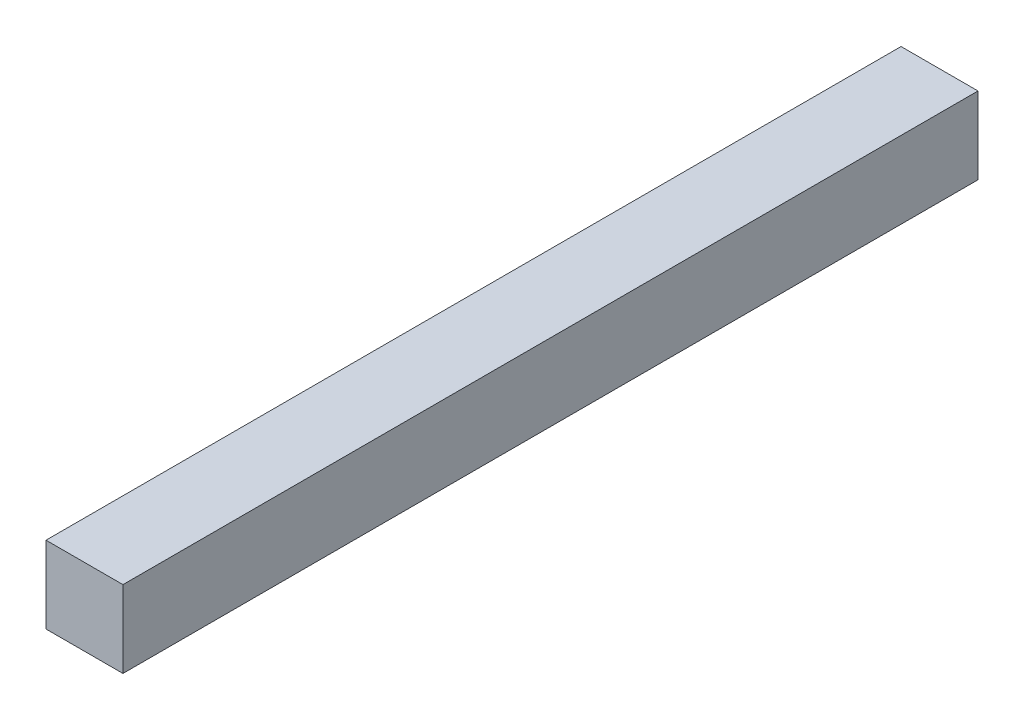
ISO-10303-21;
HEADER;
FILE_DESCRIPTION(('STEP AP214'),'2;1');
FILE_NAME('part.step','',(''),(''),'','','');
FILE_SCHEMA(('AUTOMOTIVE_DESIGN { 1 0 10303 214 1 1 1 1 }'));
ENDSEC;
DATA;
#1=APPLICATION_CONTEXT('core data for automotive mechanical design processes');
#2=APPLICATION_PROTOCOL_DEFINITION('international standard','automotive_design',2000,#1);
#3=PRODUCT_CONTEXT('',#1,'mechanical');
#4=PRODUCT('Part','Part','',(#3));
#5=PRODUCT_RELATED_PRODUCT_CATEGORY('part','',(#4));
#6=PRODUCT_DEFINITION_FORMATION('','',#4);
#7=PRODUCT_DEFINITION_CONTEXT('part definition',#1,'design');
#8=PRODUCT_DEFINITION('design','',#6,#7);
#9=PRODUCT_DEFINITION_SHAPE('','',#8);
#10=(LENGTH_UNIT() NAMED_UNIT(*) SI_UNIT(.MILLI.,.METRE.));
#11=(NAMED_UNIT(*) PLANE_ANGLE_UNIT() SI_UNIT($,.RADIAN.));
#12=(NAMED_UNIT(*) SI_UNIT($,.STERADIAN.) SOLID_ANGLE_UNIT());
#13=UNCERTAINTY_MEASURE_WITH_UNIT(LENGTH_MEASURE(1.E-05),#10,'distance_accuracy_value','');
#14=(GEOMETRIC_REPRESENTATION_CONTEXT(3) GLOBAL_UNCERTAINTY_ASSIGNED_CONTEXT((#13)) GLOBAL_UNIT_ASSIGNED_CONTEXT((#10,
#11,#12)) REPRESENTATION_CONTEXT('',''));
#15=CARTESIAN_POINT('',(0.,0.,0.));
#16=DIRECTION('',(0.,0.,1.));
#17=DIRECTION('',(1.,0.,0.));
#18=AXIS2_PLACEMENT_3D('',#15,#16,#17);
#19=CARTESIAN_POINT('',(0.,0.,500.));
#20=DIRECTION('',(1.,0.,0.));
#21=DIRECTION('',(0.,0.,-1.));
#22=AXIS2_PLACEMENT_3D('',#19,#20,#21);
#23=PLANE('',#22);
#24=DIRECTION('',(0.,-1.,0.));
#25=VECTOR('',#24,1.);
#26=CARTESIAN_POINT('',(0.,0.,0.));
#27=LINE('',#26,#25);
#28=CARTESIAN_POINT('',(0.,45.,0.));
#29=VERTEX_POINT('',#28);
#30=CARTESIAN_POINT('',(0.,0.,0.));
#31=VERTEX_POINT('',#30);
#32=EDGE_CURVE('E107',#29,#31,#27,.T.);
#33=ORIENTED_EDGE('',*,*,#32,.T.);
#34=DIRECTION('',(0.,0.,-1.));
#35=VECTOR('',#34,1.);
#36=CARTESIAN_POINT('',(0.,0.,500.));
#37=LINE('',#36,#35);
#38=CARTESIAN_POINT('',(0.,0.,500.));
#39=VERTEX_POINT('',#38);
#40=EDGE_CURVE('E11',#39,#31,#37,.T.);
#41=ORIENTED_EDGE('',*,*,#40,.F.);
#42=DIRECTION('',(0.,-1.,0.));
#43=VECTOR('',#42,1.);
#44=CARTESIAN_POINT('',(0.,0.,500.));
#45=LINE('',#44,#43);
#46=CARTESIAN_POINT('',(0.,45.,500.));
#47=VERTEX_POINT('',#46);
#48=EDGE_CURVE('E91',#47,#39,#45,.T.);
#49=ORIENTED_EDGE('',*,*,#48,.F.);
#50=DIRECTION('',(0.,0.,-1.));
#51=VECTOR('',#50,1.);
#52=CARTESIAN_POINT('',(0.,45.,500.));
#53=LINE('',#52,#51);
#54=EDGE_CURVE('E103',#47,#29,#53,.T.);
#55=ORIENTED_EDGE('',*,*,#54,.T.);
#56=EDGE_LOOP('',(#33,#41,#49,#55));
#57=FACE_BOUND('',#56,.T.);
#58=ADVANCED_FACE('F39',(#57),#23,.F.);
#59=CARTESIAN_POINT('',(0.,0.,500.));
#60=DIRECTION('',(0.,1.,0.));
#61=DIRECTION('',(0.,0.,1.));
#62=AXIS2_PLACEMENT_3D('',#59,#60,#61);
#63=PLANE('',#62);
#64=DIRECTION('',(1.,0.,0.));
#65=VECTOR('',#64,1.);
#66=CARTESIAN_POINT('',(0.,0.,0.));
#67=LINE('',#66,#65);
#68=CARTESIAN_POINT('',(45.,0.,0.));
#69=VERTEX_POINT('',#68);
#70=EDGE_CURVE('E96',#31,#69,#67,.T.);
#71=ORIENTED_EDGE('',*,*,#70,.T.);
#72=DIRECTION('',(0.,0.,-1.));
#73=VECTOR('',#72,1.);
#74=CARTESIAN_POINT('',(45.,0.,500.));
#75=LINE('',#74,#73);
#76=CARTESIAN_POINT('',(45.,0.,500.));
#77=VERTEX_POINT('',#76);
#78=EDGE_CURVE('E48',#77,#69,#75,.T.);
#79=ORIENTED_EDGE('',*,*,#78,.F.);
#80=DIRECTION('',(1.,0.,0.));
#81=VECTOR('',#80,1.);
#82=CARTESIAN_POINT('',(0.,0.,500.));
#83=LINE('',#82,#81);
#84=EDGE_CURVE('E86',#39,#77,#83,.T.);
#85=ORIENTED_EDGE('',*,*,#84,.F.);
#86=ORIENTED_EDGE('',*,*,#40,.T.);
#87=EDGE_LOOP('',(#71,#79,#85,#86));
#88=FACE_BOUND('',#87,.T.);
#89=ADVANCED_FACE('F95',(#88),#63,.F.);
#90=CARTESIAN_POINT('',(45.,0.,500.));
#91=DIRECTION('',(-1.,0.,0.));
#92=DIRECTION('',(0.,0.,1.));
#93=AXIS2_PLACEMENT_3D('',#90,#91,#92);
#94=PLANE('',#93);
#95=DIRECTION('',(0.,1.,0.));
#96=VECTOR('',#95,1.);
#97=CARTESIAN_POINT('',(45.,0.,0.));
#98=LINE('',#97,#96);
#99=CARTESIAN_POINT('',(45.,45.,0.));
#100=VERTEX_POINT('',#99);
#101=EDGE_CURVE('E73',#69,#100,#98,.T.);
#102=ORIENTED_EDGE('',*,*,#101,.T.);
#103=DIRECTION('',(0.,0.,-1.));
#104=VECTOR('',#103,1.);
#105=CARTESIAN_POINT('',(45.,45.,500.));
#106=LINE('',#105,#104);
#107=CARTESIAN_POINT('',(45.,45.,500.));
#108=VERTEX_POINT('',#107);
#109=EDGE_CURVE('E98',#108,#100,#106,.T.);
#110=ORIENTED_EDGE('',*,*,#109,.F.);
#111=DIRECTION('',(0.,1.,0.));
#112=VECTOR('',#111,1.);
#113=CARTESIAN_POINT('',(45.,0.,500.));
#114=LINE('',#113,#112);
#115=EDGE_CURVE('E89',#77,#108,#114,.T.);
#116=ORIENTED_EDGE('',*,*,#115,.F.);
#117=ORIENTED_EDGE('',*,*,#78,.T.);
#118=EDGE_LOOP('',(#102,#110,#116,#117));
#119=FACE_BOUND('',#118,.T.);
#120=ADVANCED_FACE('F99',(#119),#94,.F.);
#121=CARTESIAN_POINT('',(0.,45.,500.));
#122=DIRECTION('',(0.,-1.,0.));
#123=DIRECTION('',(0.,0.,-1.));
#124=AXIS2_PLACEMENT_3D('',#121,#122,#123);
#125=PLANE('',#124);
#126=DIRECTION('',(-1.,0.,0.));
#127=VECTOR('',#126,1.);
#128=CARTESIAN_POINT('',(0.,45.,0.));
#129=LINE('',#128,#127);
#130=EDGE_CURVE('E79',#100,#29,#129,.T.);
#131=ORIENTED_EDGE('',*,*,#130,.T.);
#132=ORIENTED_EDGE('',*,*,#54,.F.);
#133=DIRECTION('',(-1.,0.,0.));
#134=VECTOR('',#133,1.);
#135=CARTESIAN_POINT('',(0.,45.,500.));
#136=LINE('',#135,#134);
#137=EDGE_CURVE('E56',#108,#47,#136,.T.);
#138=ORIENTED_EDGE('',*,*,#137,.F.);
#139=ORIENTED_EDGE('',*,*,#109,.T.);
#140=EDGE_LOOP('',(#131,#132,#138,#139));
#141=FACE_BOUND('',#140,.T.);
#142=ADVANCED_FACE('F120',(#141),#125,.F.);
#143=CARTESIAN_POINT('',(0.,0.,500.));
#144=DIRECTION('',(0.,0.,-1.));
#145=DIRECTION('',(-1.,0.,0.));
#146=AXIS2_PLACEMENT_3D('',#143,#144,#145);
#147=PLANE('',#146);
#148=ORIENTED_EDGE('',*,*,#48,.T.);
#149=ORIENTED_EDGE('',*,*,#84,.T.);
#150=ORIENTED_EDGE('',*,*,#115,.T.);
#151=ORIENTED_EDGE('',*,*,#137,.T.);
#152=EDGE_LOOP('',(#148,#149,#150,#151));
#153=FACE_BOUND('',#152,.T.);
#154=ADVANCED_FACE('F87',(#153),#147,.F.);
#155=CARTESIAN_POINT('',(0.,0.,0.));
#156=DIRECTION('',(0.,0.,-1.));
#157=DIRECTION('',(-1.,0.,0.));
#158=AXIS2_PLACEMENT_3D('',#155,#156,#157);
#159=PLANE('',#158);
#160=ORIENTED_EDGE('',*,*,#32,.F.);
#161=ORIENTED_EDGE('',*,*,#130,.F.);
#162=ORIENTED_EDGE('',*,*,#101,.F.);
#163=ORIENTED_EDGE('',*,*,#70,.F.);
#164=EDGE_LOOP('',(#160,#161,#162,#163));
#165=FACE_BOUND('',#164,.T.);
#166=ADVANCED_FACE('F123',(#165),#159,.T.);
#167=CLOSED_SHELL('',(#58,#89,#120,#142,#154,#166));
#168=MANIFOLD_SOLID_BREP('B2',#167);
#169=ADVANCED_BREP_SHAPE_REPRESENTATION('',(#18,#168),#14);
#170=SHAPE_DEFINITION_REPRESENTATION(#9,#169);
ENDSEC;
END-ISO-10303-21;
